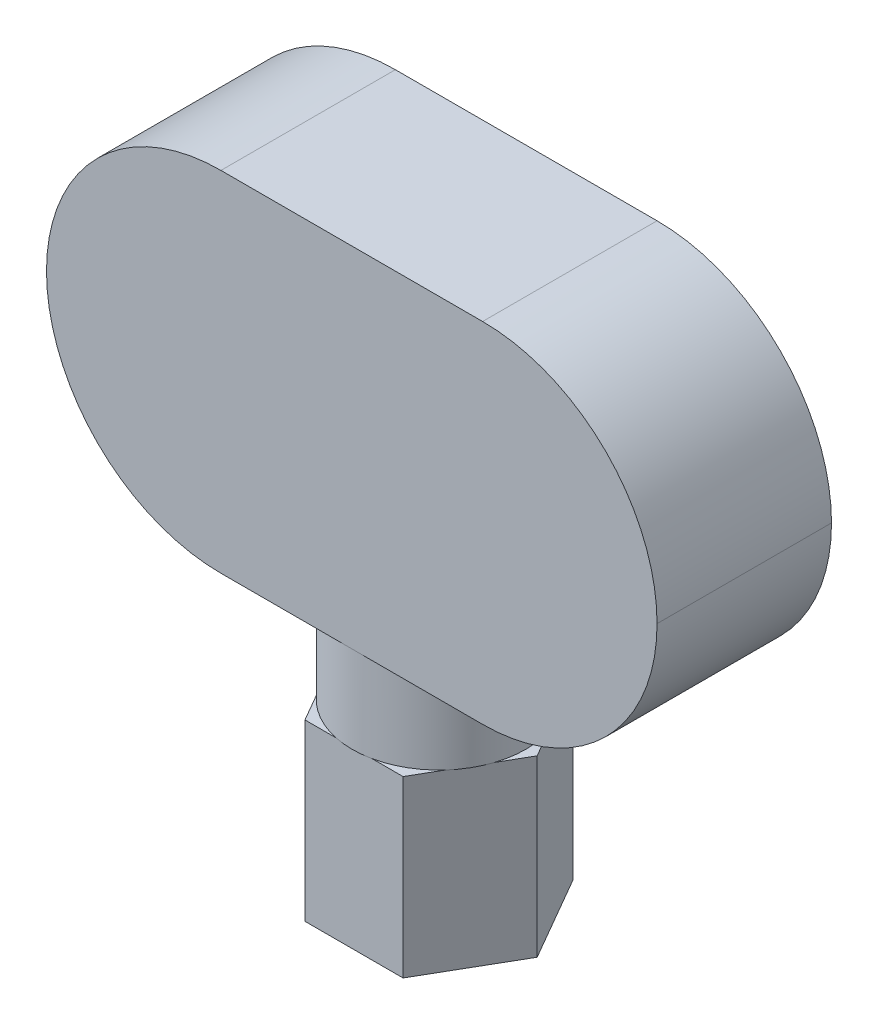
ISO-10303-21;
HEADER;
FILE_DESCRIPTION(('STEP AP214'),'2;1');
FILE_NAME('part.step','',(''),(''),'','','');
FILE_SCHEMA(('AUTOMOTIVE_DESIGN { 1 0 10303 214 1 1 1 1 }'));
ENDSEC;
DATA;
#1=APPLICATION_CONTEXT('core data for automotive mechanical design processes');
#2=APPLICATION_PROTOCOL_DEFINITION('international standard','automotive_design',2000,#1);
#3=PRODUCT_CONTEXT('',#1,'mechanical');
#4=PRODUCT('Part','Part','',(#3));
#5=PRODUCT_RELATED_PRODUCT_CATEGORY('part','',(#4));
#6=PRODUCT_DEFINITION_FORMATION('','',#4);
#7=PRODUCT_DEFINITION_CONTEXT('part definition',#1,'design');
#8=PRODUCT_DEFINITION('design','',#6,#7);
#9=PRODUCT_DEFINITION_SHAPE('','',#8);
#10=(LENGTH_UNIT() NAMED_UNIT(*) SI_UNIT(.MILLI.,.METRE.));
#11=(NAMED_UNIT(*) PLANE_ANGLE_UNIT() SI_UNIT($,.RADIAN.));
#12=(NAMED_UNIT(*) SI_UNIT($,.STERADIAN.) SOLID_ANGLE_UNIT());
#13=UNCERTAINTY_MEASURE_WITH_UNIT(LENGTH_MEASURE(1.E-05),#10,'distance_accuracy_value','');
#14=(GEOMETRIC_REPRESENTATION_CONTEXT(3) GLOBAL_UNCERTAINTY_ASSIGNED_CONTEXT((#13)) GLOBAL_UNIT_ASSIGNED_CONTEXT((#10,
#11,#12)) REPRESENTATION_CONTEXT('',''));
#15=CARTESIAN_POINT('',(0.,0.,0.));
#16=DIRECTION('',(0.,0.,1.));
#17=DIRECTION('',(1.,0.,0.));
#18=AXIS2_PLACEMENT_3D('',#15,#16,#17);
#19=CARTESIAN_POINT('',(0.,4.,0.));
#20=DIRECTION('',(0.,1.,0.));
#21=DIRECTION('',(0.,0.,1.));
#22=AXIS2_PLACEMENT_3D('',#19,#20,#21);
#23=PLANE('',#22);
#24=CARTESIAN_POINT('',(0.,4.,0.));
#25=DIRECTION('',(0.,1.,0.));
#26=DIRECTION('',(0.,0.,1.));
#27=AXIS2_PLACEMENT_3D('',#24,#25,#26);
#28=CIRCLE('',#27,1.99185842870421);
#29=CARTESIAN_POINT('',(0.413067791046463,4.,1.94855715851499));
#30=VERTEX_POINT('',#29);
#31=CARTESIAN_POINT('',(1.48096610447677,4.,1.33200577978885));
#32=VERTEX_POINT('',#31);
#33=EDGE_CURVE('E196',#30,#32,#28,.T.);
#34=ORIENTED_EDGE('',*,*,#33,.F.);
#35=DIRECTION('',(1.,0.,0.));
#36=VECTOR('',#35,1.);
#37=CARTESIAN_POINT('',(-1.125,4.,1.94855715851499));
#38=LINE('',#37,#36);
#39=CARTESIAN_POINT('',(1.125,4.,1.94855715851499));
#40=VERTEX_POINT('',#39);
#41=EDGE_CURVE('E179',#30,#40,#38,.T.);
#42=ORIENTED_EDGE('',*,*,#41,.T.);
#43=DIRECTION('',(0.499999999999999,0.,-0.866025403784439));
#44=VECTOR('',#43,1.);
#45=CARTESIAN_POINT('',(1.125,4.,1.94855715851499));
#46=LINE('',#45,#44);
#47=EDGE_CURVE('E275',#40,#32,#46,.T.);
#48=ORIENTED_EDGE('',*,*,#47,.T.);
#49=EDGE_LOOP('',(#34,#42,#48));
#50=FACE_BOUND('',#49,.T.);
#51=ADVANCED_FACE('F39',(#50),#23,.T.);
#52=CARTESIAN_POINT('',(1.89403389552323,4.,0.61655137872613));
#53=VERTEX_POINT('',#52);
#54=CARTESIAN_POINT('',(1.89403389552323,4.,-0.616551378726134));
#55=VERTEX_POINT('',#54);
#56=EDGE_CURVE('E221',#53,#55,#28,.T.);
#57=ORIENTED_EDGE('',*,*,#56,.F.);
#58=CARTESIAN_POINT('',(2.25,4.,0.));
#59=VERTEX_POINT('',#58);
#60=EDGE_CURVE('E176',#53,#59,#46,.T.);
#61=ORIENTED_EDGE('',*,*,#60,.T.);
#62=DIRECTION('',(-0.5,0.,-0.866025403784439));
#63=VECTOR('',#62,1.);
#64=CARTESIAN_POINT('',(2.25,4.,0.));
#65=LINE('',#64,#63);
#66=EDGE_CURVE('E258',#59,#55,#65,.T.);
#67=ORIENTED_EDGE('',*,*,#66,.T.);
#68=EDGE_LOOP('',(#57,#61,#67));
#69=FACE_BOUND('',#68,.T.);
#70=ADVANCED_FACE('F398',(#69),#23,.T.);
#71=CARTESIAN_POINT('',(1.48096610447677,4.,-1.33200577978885));
#72=VERTEX_POINT('',#71);
#73=CARTESIAN_POINT('',(0.413067791046466,4.,-1.94855715851499));
#74=VERTEX_POINT('',#73);
#75=EDGE_CURVE('E229',#72,#74,#28,.T.);
#76=ORIENTED_EDGE('',*,*,#75,.F.);
#77=CARTESIAN_POINT('',(1.125,4.,-1.94855715851499));
#78=VERTEX_POINT('',#77);
#79=EDGE_CURVE('E299',#72,#78,#65,.T.);
#80=ORIENTED_EDGE('',*,*,#79,.T.);
#81=DIRECTION('',(-1.,0.,0.));
#82=VECTOR('',#81,1.);
#83=CARTESIAN_POINT('',(1.125,4.,-1.94855715851499));
#84=LINE('',#83,#82);
#85=EDGE_CURVE('E260',#78,#74,#84,.T.);
#86=ORIENTED_EDGE('',*,*,#85,.T.);
#87=EDGE_LOOP('',(#76,#80,#86));
#88=FACE_BOUND('',#87,.T.);
#89=ADVANCED_FACE('F404',(#88),#23,.T.);
#90=CARTESIAN_POINT('',(-0.413067791046466,4.,-1.94855715851499));
#91=VERTEX_POINT('',#90);
#92=CARTESIAN_POINT('',(-1.48096610447677,4.,-1.33200577978886));
#93=VERTEX_POINT('',#92);
#94=EDGE_CURVE('E206',#91,#93,#28,.T.);
#95=ORIENTED_EDGE('',*,*,#94,.F.);
#96=CARTESIAN_POINT('',(-1.125,4.,-1.94855715851499));
#97=VERTEX_POINT('',#96);
#98=EDGE_CURVE('E246',#91,#97,#84,.T.);
#99=ORIENTED_EDGE('',*,*,#98,.T.);
#100=DIRECTION('',(-0.5,0.,0.866025403784439));
#101=VECTOR('',#100,1.);
#102=CARTESIAN_POINT('',(-1.125,4.,-1.94855715851499));
#103=LINE('',#102,#101);
#104=EDGE_CURVE('E249',#97,#93,#103,.T.);
#105=ORIENTED_EDGE('',*,*,#104,.T.);
#106=EDGE_LOOP('',(#95,#99,#105));
#107=FACE_BOUND('',#106,.T.);
#108=ADVANCED_FACE('F245',(#107),#23,.T.);
#109=CARTESIAN_POINT('',(-1.89403389552323,4.,-0.616551378726129));
#110=VERTEX_POINT('',#109);
#111=CARTESIAN_POINT('',(-1.89403389552323,4.,0.61655137872613));
#112=VERTEX_POINT('',#111);
#113=EDGE_CURVE('E202',#110,#112,#28,.T.);
#114=ORIENTED_EDGE('',*,*,#113,.F.);
#115=CARTESIAN_POINT('',(-2.25,4.,0.));
#116=VERTEX_POINT('',#115);
#117=EDGE_CURVE('E265',#110,#116,#103,.T.);
#118=ORIENTED_EDGE('',*,*,#117,.T.);
#119=DIRECTION('',(0.5,0.,0.866025403784438));
#120=VECTOR('',#119,1.);
#121=CARTESIAN_POINT('',(-2.25,4.,0.));
#122=LINE('',#121,#120);
#123=EDGE_CURVE('E270',#116,#112,#122,.T.);
#124=ORIENTED_EDGE('',*,*,#123,.T.);
#125=EDGE_LOOP('',(#114,#118,#124));
#126=FACE_BOUND('',#125,.T.);
#127=ADVANCED_FACE('F411',(#126),#23,.T.);
#128=CARTESIAN_POINT('',(2.25,4.,0.));
#129=DIRECTION('',(-0.866025403784439,0.,0.5));
#130=DIRECTION('',(0.5,0.,0.866025403784439));
#131=AXIS2_PLACEMENT_3D('',#128,#129,#130);
#132=PLANE('',#131);
#133=DIRECTION('',(-0.5,0.,-0.866025403784439));
#134=VECTOR('',#133,1.);
#135=CARTESIAN_POINT('',(2.25,0.,0.));
#136=LINE('',#135,#134);
#137=CARTESIAN_POINT('',(2.25,0.,0.));
#138=VERTEX_POINT('',#137);
#139=CARTESIAN_POINT('',(1.125,0.,-1.94855715851499));
#140=VERTEX_POINT('',#139);
#141=EDGE_CURVE('E219',#138,#140,#136,.T.);
#142=ORIENTED_EDGE('',*,*,#141,.T.);
#143=DIRECTION('',(0.,-1.,0.));
#144=VECTOR('',#143,1.);
#145=CARTESIAN_POINT('',(1.125,4.,-1.94855715851499));
#146=LINE('',#145,#144);
#147=EDGE_CURVE('E203',#78,#140,#146,.T.);
#148=ORIENTED_EDGE('',*,*,#147,.F.);
#149=ORIENTED_EDGE('',*,*,#79,.F.);
#150=EDGE_CURVE('E461',#55,#72,#65,.T.);
#151=ORIENTED_EDGE('',*,*,#150,.F.);
#152=ORIENTED_EDGE('',*,*,#66,.F.);
#153=DIRECTION('',(0.,-1.,0.));
#154=VECTOR('',#153,1.);
#155=CARTESIAN_POINT('',(2.25,4.,0.));
#156=LINE('',#155,#154);
#157=EDGE_CURVE('E279',#59,#138,#156,.T.);
#158=ORIENTED_EDGE('',*,*,#157,.T.);
#159=EDGE_LOOP('',(#142,#148,#149,#151,#152,#158));
#160=FACE_BOUND('',#159,.T.);
#161=ADVANCED_FACE('F421',(#160),#132,.F.);
#162=CARTESIAN_POINT('',(1.125,4.,-1.94855715851499));
#163=DIRECTION('',(0.,0.,1.));
#164=DIRECTION('',(1.,0.,0.));
#165=AXIS2_PLACEMENT_3D('',#162,#163,#164);
#166=PLANE('',#165);
#167=DIRECTION('',(-1.,0.,0.));
#168=VECTOR('',#167,1.);
#169=CARTESIAN_POINT('',(1.125,0.,-1.94855715851499));
#170=LINE('',#169,#168);
#171=CARTESIAN_POINT('',(-1.125,0.,-1.94855715851499));
#172=VERTEX_POINT('',#171);
#173=EDGE_CURVE('E284',#140,#172,#170,.T.);
#174=ORIENTED_EDGE('',*,*,#173,.T.);
#175=DIRECTION('',(0.,-1.,0.));
#176=VECTOR('',#175,1.);
#177=CARTESIAN_POINT('',(-1.125,4.,-1.94855715851499));
#178=LINE('',#177,#176);
#179=EDGE_CURVE('E208',#97,#172,#178,.T.);
#180=ORIENTED_EDGE('',*,*,#179,.F.);
#181=ORIENTED_EDGE('',*,*,#98,.F.);
#182=EDGE_CURVE('E254',#74,#91,#84,.T.);
#183=ORIENTED_EDGE('',*,*,#182,.F.);
#184=ORIENTED_EDGE('',*,*,#85,.F.);
#185=ORIENTED_EDGE('',*,*,#147,.T.);
#186=EDGE_LOOP('',(#174,#180,#181,#183,#184,#185));
#187=FACE_BOUND('',#186,.T.);
#188=ADVANCED_FACE('F252',(#187),#166,.F.);
#189=CARTESIAN_POINT('',(-1.125,4.,-1.94855715851499));
#190=DIRECTION('',(0.866025403784439,0.,0.499999999999999));
#191=DIRECTION('',(0.5,0.,-0.866025403784439));
#192=AXIS2_PLACEMENT_3D('',#189,#190,#191);
#193=PLANE('',#192);
#194=DIRECTION('',(-0.5,0.,0.866025403784439));
#195=VECTOR('',#194,1.);
#196=CARTESIAN_POINT('',(-1.125,0.,-1.94855715851499));
#197=LINE('',#196,#195);
#198=CARTESIAN_POINT('',(-2.25,0.,0.));
#199=VERTEX_POINT('',#198);
#200=EDGE_CURVE('E287',#172,#199,#197,.T.);
#201=ORIENTED_EDGE('',*,*,#200,.T.);
#202=DIRECTION('',(0.,-1.,0.));
#203=VECTOR('',#202,1.);
#204=CARTESIAN_POINT('',(-2.25,4.,0.));
#205=LINE('',#204,#203);
#206=EDGE_CURVE('E310',#116,#199,#205,.T.);
#207=ORIENTED_EDGE('',*,*,#206,.F.);
#208=ORIENTED_EDGE('',*,*,#117,.F.);
#209=EDGE_CURVE('E269',#93,#110,#103,.T.);
#210=ORIENTED_EDGE('',*,*,#209,.F.);
#211=ORIENTED_EDGE('',*,*,#104,.F.);
#212=ORIENTED_EDGE('',*,*,#179,.T.);
#213=EDGE_LOOP('',(#201,#207,#208,#210,#211,#212));
#214=FACE_BOUND('',#213,.T.);
#215=ADVANCED_FACE('F434',(#214),#193,.F.);
#216=CARTESIAN_POINT('',(-2.25,4.,0.));
#217=DIRECTION('',(0.866025403784438,0.,-0.5));
#218=DIRECTION('',(-0.5,0.,-0.866025403784438));
#219=AXIS2_PLACEMENT_3D('',#216,#217,#218);
#220=PLANE('',#219);
#221=DIRECTION('',(0.5,0.,0.866025403784438));
#222=VECTOR('',#221,1.);
#223=CARTESIAN_POINT('',(-2.25,0.,0.));
#224=LINE('',#223,#222);
#225=CARTESIAN_POINT('',(-1.125,0.,1.94855715851499));
#226=VERTEX_POINT('',#225);
#227=EDGE_CURVE('E290',#199,#226,#224,.T.);
#228=ORIENTED_EDGE('',*,*,#227,.T.);
#229=DIRECTION('',(0.,-1.,0.));
#230=VECTOR('',#229,1.);
#231=CARTESIAN_POINT('',(-1.125,4.,1.94855715851499));
#232=LINE('',#231,#230);
#233=CARTESIAN_POINT('',(-1.125,4.,1.94855715851499));
#234=VERTEX_POINT('',#233);
#235=EDGE_CURVE('E307',#234,#226,#232,.T.);
#236=ORIENTED_EDGE('',*,*,#235,.F.);
#237=CARTESIAN_POINT('',(-1.48096610447676,4.,1.33200577978886));
#238=VERTEX_POINT('',#237);
#239=EDGE_CURVE('E171',#238,#234,#122,.T.);
#240=ORIENTED_EDGE('',*,*,#239,.F.);
#241=EDGE_CURVE('E273',#112,#238,#122,.T.);
#242=ORIENTED_EDGE('',*,*,#241,.F.);
#243=ORIENTED_EDGE('',*,*,#123,.F.);
#244=ORIENTED_EDGE('',*,*,#206,.T.);
#245=EDGE_LOOP('',(#228,#236,#240,#242,#243,#244));
#246=FACE_BOUND('',#245,.T.);
#247=ADVANCED_FACE('F468',(#246),#220,.F.);
#248=CARTESIAN_POINT('',(-1.125,4.,1.94855715851499));
#249=DIRECTION('',(0.,0.,-1.));
#250=DIRECTION('',(-1.,0.,0.));
#251=AXIS2_PLACEMENT_3D('',#248,#249,#250);
#252=PLANE('',#251);
#253=DIRECTION('',(1.,0.,0.));
#254=VECTOR('',#253,1.);
#255=CARTESIAN_POINT('',(-1.125,0.,1.94855715851499));
#256=LINE('',#255,#254);
#257=CARTESIAN_POINT('',(1.125,0.,1.94855715851499));
#258=VERTEX_POINT('',#257);
#259=EDGE_CURVE('E293',#226,#258,#256,.T.);
#260=ORIENTED_EDGE('',*,*,#259,.T.);
#261=DIRECTION('',(0.,-1.,0.));
#262=VECTOR('',#261,1.);
#263=CARTESIAN_POINT('',(1.125,4.,1.94855715851499));
#264=LINE('',#263,#262);
#265=EDGE_CURVE('E303',#40,#258,#264,.T.);
#266=ORIENTED_EDGE('',*,*,#265,.F.);
#267=ORIENTED_EDGE('',*,*,#41,.F.);
#268=CARTESIAN_POINT('',(-0.413067791046463,4.,1.94855715851499));
#269=VERTEX_POINT('',#268);
#270=EDGE_CURVE('E177',#269,#30,#38,.T.);
#271=ORIENTED_EDGE('',*,*,#270,.F.);
#272=EDGE_CURVE('E165',#234,#269,#38,.T.);
#273=ORIENTED_EDGE('',*,*,#272,.F.);
#274=ORIENTED_EDGE('',*,*,#235,.T.);
#275=EDGE_LOOP('',(#260,#266,#267,#271,#273,#274));
#276=FACE_BOUND('',#275,.T.);
#277=ADVANCED_FACE('F183',(#276),#252,.F.);
#278=CARTESIAN_POINT('',(1.125,4.,1.94855715851499));
#279=DIRECTION('',(-0.866025403784439,0.,-0.5));
#280=DIRECTION('',(-0.5,0.,0.866025403784439));
#281=AXIS2_PLACEMENT_3D('',#278,#279,#280);
#282=PLANE('',#281);
#283=DIRECTION('',(0.499999999999999,0.,-0.866025403784439));
#284=VECTOR('',#283,1.);
#285=CARTESIAN_POINT('',(1.125,0.,1.94855715851499));
#286=LINE('',#285,#284);
#287=EDGE_CURVE('E296',#258,#138,#286,.T.);
#288=ORIENTED_EDGE('',*,*,#287,.T.);
#289=ORIENTED_EDGE('',*,*,#157,.F.);
#290=ORIENTED_EDGE('',*,*,#60,.F.);
#291=EDGE_CURVE('E280',#32,#53,#46,.T.);
#292=ORIENTED_EDGE('',*,*,#291,.F.);
#293=ORIENTED_EDGE('',*,*,#47,.F.);
#294=ORIENTED_EDGE('',*,*,#265,.T.);
#295=EDGE_LOOP('',(#288,#289,#290,#292,#293,#294));
#296=FACE_BOUND('',#295,.T.);
#297=ADVANCED_FACE('F410',(#296),#282,.F.);
#298=EDGE_CURVE('E169',#238,#269,#28,.T.);
#299=ORIENTED_EDGE('',*,*,#298,.F.);
#300=ORIENTED_EDGE('',*,*,#239,.T.);
#301=ORIENTED_EDGE('',*,*,#272,.T.);
#302=EDGE_LOOP('',(#299,#300,#301));
#303=FACE_BOUND('',#302,.T.);
#304=ADVANCED_FACE('F167',(#303),#23,.T.);
#305=CARTESIAN_POINT('',(0.,0.,0.));
#306=DIRECTION('',(0.,1.,0.));
#307=DIRECTION('',(0.,0.,1.));
#308=AXIS2_PLACEMENT_3D('',#305,#306,#307);
#309=PLANE('',#308);
#310=ORIENTED_EDGE('',*,*,#141,.F.);
#311=ORIENTED_EDGE('',*,*,#287,.F.);
#312=ORIENTED_EDGE('',*,*,#259,.F.);
#313=ORIENTED_EDGE('',*,*,#227,.F.);
#314=ORIENTED_EDGE('',*,*,#200,.F.);
#315=ORIENTED_EDGE('',*,*,#173,.F.);
#316=EDGE_LOOP('',(#310,#311,#312,#313,#314,#315));
#317=FACE_BOUND('',#316,.T.);
#318=ADVANCED_FACE('F409',(#317),#309,.F.);
#319=CARTESIAN_POINT('',(0.,4.,0.));
#320=DIRECTION('',(0.,1.,0.));
#321=DIRECTION('',(0.,0.,1.));
#322=AXIS2_PLACEMENT_3D('',#319,#320,#321);
#323=PLANE('',#322);
#324=EDGE_CURVE('E220',#55,#72,#28,.T.);
#325=ORIENTED_EDGE('',*,*,#324,.F.);
#326=ORIENTED_EDGE('',*,*,#150,.T.);
#327=EDGE_LOOP('',(#325,#326));
#328=FACE_BOUND('',#327,.T.);
#329=ADVANCED_FACE('F416',(#328),#323,.F.);
#330=EDGE_CURVE('E226',#74,#91,#28,.T.);
#331=ORIENTED_EDGE('',*,*,#330,.F.);
#332=ORIENTED_EDGE('',*,*,#182,.T.);
#333=EDGE_LOOP('',(#331,#332));
#334=FACE_BOUND('',#333,.T.);
#335=ADVANCED_FACE('F262',(#334),#323,.F.);
#336=EDGE_CURVE('E240',#93,#110,#28,.T.);
#337=ORIENTED_EDGE('',*,*,#336,.F.);
#338=ORIENTED_EDGE('',*,*,#209,.T.);
#339=EDGE_LOOP('',(#337,#338));
#340=FACE_BOUND('',#339,.T.);
#341=ADVANCED_FACE('F437',(#340),#323,.F.);
#342=EDGE_CURVE('E193',#112,#238,#28,.T.);
#343=ORIENTED_EDGE('',*,*,#342,.F.);
#344=ORIENTED_EDGE('',*,*,#241,.T.);
#345=EDGE_LOOP('',(#343,#344));
#346=FACE_BOUND('',#345,.T.);
#347=ADVANCED_FACE('F470',(#346),#323,.F.);
#348=EDGE_CURVE('E188',#269,#30,#28,.T.);
#349=ORIENTED_EDGE('',*,*,#348,.F.);
#350=ORIENTED_EDGE('',*,*,#270,.T.);
#351=EDGE_LOOP('',(#349,#350));
#352=FACE_BOUND('',#351,.T.);
#353=ADVANCED_FACE('F189',(#352),#323,.F.);
#354=EDGE_CURVE('E214',#32,#53,#28,.T.);
#355=ORIENTED_EDGE('',*,*,#354,.F.);
#356=ORIENTED_EDGE('',*,*,#291,.T.);
#357=EDGE_LOOP('',(#355,#356));
#358=FACE_BOUND('',#357,.T.);
#359=ADVANCED_FACE('F447',(#358),#323,.F.);
#360=CARTESIAN_POINT('',(0.,6.,0.));
#361=DIRECTION('',(0.,-1.,0.));
#362=DIRECTION('',(0.,0.,-1.));
#363=AXIS2_PLACEMENT_3D('',#360,#361,#362);
#364=CYLINDRICAL_SURFACE('',#363,1.99185842870421);
#365=CARTESIAN_POINT('',(0.,6.,0.));
#366=DIRECTION('',(0.,1.,0.));
#367=DIRECTION('',(0.,0.,1.));
#368=AXIS2_PLACEMENT_3D('',#365,#366,#367);
#369=CIRCLE('',#368,1.99185842870421);
#370=CARTESIAN_POINT('',(0.,6.,1.99185842870421));
#371=VERTEX_POINT('',#370);
#372=EDGE_CURVE('E213',#371,#371,#369,.T.);
#373=ORIENTED_EDGE('',*,*,#372,.F.);
#374=EDGE_LOOP('',(#373));
#375=FACE_BOUND('',#374,.T.);
#376=ORIENTED_EDGE('',*,*,#33,.T.);
#377=ORIENTED_EDGE('',*,*,#354,.T.);
#378=ORIENTED_EDGE('',*,*,#56,.T.);
#379=ORIENTED_EDGE('',*,*,#324,.T.);
#380=ORIENTED_EDGE('',*,*,#75,.T.);
#381=ORIENTED_EDGE('',*,*,#330,.T.);
#382=ORIENTED_EDGE('',*,*,#94,.T.);
#383=ORIENTED_EDGE('',*,*,#336,.T.);
#384=ORIENTED_EDGE('',*,*,#113,.T.);
#385=ORIENTED_EDGE('',*,*,#342,.T.);
#386=ORIENTED_EDGE('',*,*,#298,.T.);
#387=ORIENTED_EDGE('',*,*,#348,.T.);
#388=EDGE_LOOP('',(#376,#377,#378,#379,#380,#381,#382,#383,#384,#385,#386,#387));
#389=FACE_BOUND('',#388,.T.);
#390=ADVANCED_FACE('F198',(#375,#389),#364,.T.);
#391=CARTESIAN_POINT('',(-7.,14.,-2.));
#392=DIRECTION('',(0.,0.,1.));
#393=DIRECTION('',(1.,0.,0.));
#394=AXIS2_PLACEMENT_3D('',#391,#392,#393);
#395=PLANE('',#394);
#396=CARTESIAN_POINT('',(3.,10.,-2.));
#397=DIRECTION('',(0.,0.,1.));
#398=DIRECTION('',(1.,0.,0.));
#399=AXIS2_PLACEMENT_3D('',#396,#397,#398);
#400=CIRCLE('',#399,4.);
#401=CARTESIAN_POINT('',(3.,14.,-2.));
#402=VERTEX_POINT('',#401);
#403=CARTESIAN_POINT('',(7.,10.,-2.));
#404=VERTEX_POINT('',#403);
#405=EDGE_CURVE('E318',#402,#404,#400,.F.);
#406=ORIENTED_EDGE('',*,*,#405,.T.);
#407=CARTESIAN_POINT('',(3.,10.,-2.));
#408=DIRECTION('',(0.,0.,1.));
#409=DIRECTION('',(1.,0.,0.));
#410=AXIS2_PLACEMENT_3D('',#407,#408,#409);
#411=CIRCLE('',#410,4.);
#412=CARTESIAN_POINT('',(3.,6.,-2.));
#413=VERTEX_POINT('',#412);
#414=EDGE_CURVE('E321',#404,#413,#411,.F.);
#415=ORIENTED_EDGE('',*,*,#414,.T.);
#416=DIRECTION('',(-1.,0.,0.));
#417=VECTOR('',#416,1.);
#418=CARTESIAN_POINT('',(-7.,6.,-2.));
#419=LINE('',#418,#417);
#420=CARTESIAN_POINT('',(-3.,6.,-2.));
#421=VERTEX_POINT('',#420);
#422=EDGE_CURVE('E346',#413,#421,#419,.T.);
#423=ORIENTED_EDGE('',*,*,#422,.T.);
#424=CARTESIAN_POINT('',(-3.,10.,-2.));
#425=DIRECTION('',(0.,0.,1.));
#426=DIRECTION('',(1.,0.,0.));
#427=AXIS2_PLACEMENT_3D('',#424,#425,#426);
#428=CIRCLE('',#427,4.);
#429=CARTESIAN_POINT('',(-7.,10.,-2.));
#430=VERTEX_POINT('',#429);
#431=EDGE_CURVE('E232',#421,#430,#428,.F.);
#432=ORIENTED_EDGE('',*,*,#431,.T.);
#433=CARTESIAN_POINT('',(-3.,10.,-2.));
#434=DIRECTION('',(0.,0.,1.));
#435=DIRECTION('',(1.,0.,0.));
#436=AXIS2_PLACEMENT_3D('',#433,#434,#435);
#437=CIRCLE('',#436,4.);
#438=CARTESIAN_POINT('',(-3.,14.,-2.));
#439=VERTEX_POINT('',#438);
#440=EDGE_CURVE('E228',#430,#439,#437,.F.);
#441=ORIENTED_EDGE('',*,*,#440,.T.);
#442=DIRECTION('',(-1.,0.,0.));
#443=VECTOR('',#442,1.);
#444=CARTESIAN_POINT('',(-7.,14.,-2.));
#445=LINE('',#444,#443);
#446=EDGE_CURVE('E367',#402,#439,#445,.T.);
#447=ORIENTED_EDGE('',*,*,#446,.F.);
#448=EDGE_LOOP('',(#406,#415,#423,#432,#441,#447));
#449=FACE_BOUND('',#448,.T.);
#450=ADVANCED_FACE('F366',(#449),#395,.F.);
#451=CARTESIAN_POINT('',(-7.,14.,2.));
#452=DIRECTION('',(0.,0.,-1.));
#453=DIRECTION('',(-1.,0.,0.));
#454=AXIS2_PLACEMENT_3D('',#451,#452,#453);
#455=PLANE('',#454);
#456=DIRECTION('',(1.,0.,0.));
#457=VECTOR('',#456,1.);
#458=CARTESIAN_POINT('',(-7.,6.,2.));
#459=LINE('',#458,#457);
#460=CARTESIAN_POINT('',(-3.,6.,2.));
#461=VERTEX_POINT('',#460);
#462=CARTESIAN_POINT('',(2.99999999999999,6.,2.));
#463=VERTEX_POINT('',#462);
#464=EDGE_CURVE('E353',#461,#463,#459,.T.);
#465=ORIENTED_EDGE('',*,*,#464,.T.);
#466=CARTESIAN_POINT('',(3.,10.,2.));
#467=DIRECTION('',(0.,0.,-1.));
#468=DIRECTION('',(-1.,0.,0.));
#469=AXIS2_PLACEMENT_3D('',#466,#467,#468);
#470=CIRCLE('',#469,4.);
#471=CARTESIAN_POINT('',(7.,10.,2.));
#472=VERTEX_POINT('',#471);
#473=EDGE_CURVE('E339',#463,#472,#470,.F.);
#474=ORIENTED_EDGE('',*,*,#473,.T.);
#475=CARTESIAN_POINT('',(3.,10.,2.));
#476=DIRECTION('',(0.,0.,-1.));
#477=DIRECTION('',(-1.,0.,0.));
#478=AXIS2_PLACEMENT_3D('',#475,#476,#477);
#479=CIRCLE('',#478,4.);
#480=CARTESIAN_POINT('',(2.99999999999999,14.,2.));
#481=VERTEX_POINT('',#480);
#482=EDGE_CURVE('E63',#472,#481,#479,.F.);
#483=ORIENTED_EDGE('',*,*,#482,.T.);
#484=DIRECTION('',(1.,0.,0.));
#485=VECTOR('',#484,1.);
#486=CARTESIAN_POINT('',(-7.,14.,2.));
#487=LINE('',#486,#485);
#488=CARTESIAN_POINT('',(-3.,14.,2.));
#489=VERTEX_POINT('',#488);
#490=EDGE_CURVE('E194',#489,#481,#487,.T.);
#491=ORIENTED_EDGE('',*,*,#490,.F.);
#492=CARTESIAN_POINT('',(-3.,10.,2.));
#493=DIRECTION('',(0.,0.,-1.));
#494=DIRECTION('',(-1.,0.,0.));
#495=AXIS2_PLACEMENT_3D('',#492,#493,#494);
#496=CIRCLE('',#495,4.);
#497=CARTESIAN_POINT('',(-7.,10.,2.));
#498=VERTEX_POINT('',#497);
#499=EDGE_CURVE('E57',#489,#498,#496,.F.);
#500=ORIENTED_EDGE('',*,*,#499,.T.);
#501=CARTESIAN_POINT('',(-3.,10.,2.));
#502=DIRECTION('',(0.,0.,-1.));
#503=DIRECTION('',(-1.,0.,0.));
#504=AXIS2_PLACEMENT_3D('',#501,#502,#503);
#505=CIRCLE('',#504,4.);
#506=EDGE_CURVE('E334',#498,#461,#505,.F.);
#507=ORIENTED_EDGE('',*,*,#506,.T.);
#508=EDGE_LOOP('',(#465,#474,#483,#491,#500,#507));
#509=FACE_BOUND('',#508,.T.);
#510=ADVANCED_FACE('F380',(#509),#455,.F.);
#511=CARTESIAN_POINT('',(0.,14.,0.));
#512=DIRECTION('',(0.,1.,0.));
#513=DIRECTION('',(0.,0.,1.));
#514=AXIS2_PLACEMENT_3D('',#511,#512,#513);
#515=PLANE('',#514);
#516=ORIENTED_EDGE('',*,*,#490,.T.);
#517=DIRECTION('',(0.,0.,-1.));
#518=VECTOR('',#517,1.);
#519=CARTESIAN_POINT('',(3.,14.,-2.));
#520=LINE('',#519,#518);
#521=EDGE_CURVE('E11',#481,#402,#520,.T.);
#522=ORIENTED_EDGE('',*,*,#521,.T.);
#523=ORIENTED_EDGE('',*,*,#446,.T.);
#524=DIRECTION('',(0.,0.,1.));
#525=VECTOR('',#524,1.);
#526=CARTESIAN_POINT('',(-3.,14.,2.));
#527=LINE('',#526,#525);
#528=EDGE_CURVE('E49',#439,#489,#527,.T.);
#529=ORIENTED_EDGE('',*,*,#528,.T.);
#530=EDGE_LOOP('',(#516,#522,#523,#529));
#531=FACE_BOUND('',#530,.T.);
#532=ADVANCED_FACE('F370',(#531),#515,.T.);
#533=CARTESIAN_POINT('',(0.,6.,0.));
#534=DIRECTION('',(0.,1.,0.));
#535=DIRECTION('',(0.,0.,1.));
#536=AXIS2_PLACEMENT_3D('',#533,#534,#535);
#537=PLANE('',#536);
#538=ORIENTED_EDGE('',*,*,#372,.T.);
#539=EDGE_LOOP('',(#538));
#540=FACE_BOUND('',#539,.T.);
#541=ORIENTED_EDGE('',*,*,#422,.F.);
#542=DIRECTION('',(0.,0.,-1.));
#543=VECTOR('',#542,1.);
#544=CARTESIAN_POINT('',(3.,6.,0.));
#545=LINE('',#544,#543);
#546=EDGE_CURVE('E328',#413,#463,#545,.F.);
#547=ORIENTED_EDGE('',*,*,#546,.T.);
#548=ORIENTED_EDGE('',*,*,#464,.F.);
#549=DIRECTION('',(0.,0.,1.));
#550=VECTOR('',#549,1.);
#551=CARTESIAN_POINT('',(-3.,6.,0.));
#552=LINE('',#551,#550);
#553=EDGE_CURVE('E324',#461,#421,#552,.F.);
#554=ORIENTED_EDGE('',*,*,#553,.T.);
#555=EDGE_LOOP('',(#541,#547,#548,#554));
#556=FACE_BOUND('',#555,.T.);
#557=ADVANCED_FACE('F383',(#540,#556),#537,.F.);
#558=CARTESIAN_POINT('',(3.,10.,0.));
#559=DIRECTION('',(0.,0.,1.));
#560=DIRECTION('',(1.,0.,0.));
#561=AXIS2_PLACEMENT_3D('',#558,#559,#560);
#562=CYLINDRICAL_SURFACE('',#561,4.);
#563=ORIENTED_EDGE('',*,*,#521,.F.);
#564=ORIENTED_EDGE('',*,*,#482,.F.);
#565=DIRECTION('',(0.,0.,-1.));
#566=VECTOR('',#565,1.);
#567=CARTESIAN_POINT('',(7.,10.,2.));
#568=LINE('',#567,#566);
#569=EDGE_CURVE('E343',#404,#472,#568,.F.);
#570=ORIENTED_EDGE('',*,*,#569,.F.);
#571=ORIENTED_EDGE('',*,*,#405,.F.);
#572=EDGE_LOOP('',(#563,#564,#570,#571));
#573=FACE_BOUND('',#572,.T.);
#574=ADVANCED_FACE('F387',(#573),#562,.T.);
#575=CARTESIAN_POINT('',(3.,10.,-2.));
#576=DIRECTION('',(0.,0.,-1.));
#577=DIRECTION('',(-1.,0.,0.));
#578=AXIS2_PLACEMENT_3D('',#575,#576,#577);
#579=CYLINDRICAL_SURFACE('',#578,4.);
#580=ORIENTED_EDGE('',*,*,#473,.F.);
#581=ORIENTED_EDGE('',*,*,#546,.F.);
#582=ORIENTED_EDGE('',*,*,#414,.F.);
#583=ORIENTED_EDGE('',*,*,#569,.T.);
#584=EDGE_LOOP('',(#580,#581,#582,#583));
#585=FACE_BOUND('',#584,.T.);
#586=ADVANCED_FACE('F385',(#585),#579,.T.);
#587=CARTESIAN_POINT('',(-3.,10.,0.));
#588=DIRECTION('',(0.,0.,-1.));
#589=DIRECTION('',(-1.,0.,0.));
#590=AXIS2_PLACEMENT_3D('',#587,#588,#589);
#591=CYLINDRICAL_SURFACE('',#590,4.);
#592=ORIENTED_EDGE('',*,*,#528,.F.);
#593=ORIENTED_EDGE('',*,*,#440,.F.);
#594=DIRECTION('',(0.,0.,1.));
#595=VECTOR('',#594,1.);
#596=CARTESIAN_POINT('',(-7.,10.,-2.));
#597=LINE('',#596,#595);
#598=EDGE_CURVE('E43',#498,#430,#597,.F.);
#599=ORIENTED_EDGE('',*,*,#598,.F.);
#600=ORIENTED_EDGE('',*,*,#499,.F.);
#601=EDGE_LOOP('',(#592,#593,#599,#600));
#602=FACE_BOUND('',#601,.T.);
#603=ADVANCED_FACE('F41',(#602),#591,.T.);
#604=CARTESIAN_POINT('',(-3.,10.,-2.));
#605=DIRECTION('',(0.,0.,1.));
#606=DIRECTION('',(1.,0.,0.));
#607=AXIS2_PLACEMENT_3D('',#604,#605,#606);
#608=CYLINDRICAL_SURFACE('',#607,4.);
#609=ORIENTED_EDGE('',*,*,#431,.F.);
#610=ORIENTED_EDGE('',*,*,#553,.F.);
#611=ORIENTED_EDGE('',*,*,#506,.F.);
#612=ORIENTED_EDGE('',*,*,#598,.T.);
#613=EDGE_LOOP('',(#609,#610,#611,#612));
#614=FACE_BOUND('',#613,.T.);
#615=ADVANCED_FACE('F358',(#614),#608,.T.);
#616=CLOSED_SHELL('',(#51,#70,#89,#108,#127,#161,#188,#215,#247,#277,#297,#304,#318,#329,#335,
#341,#347,#353,#359,#390,#450,#510,#532,#557,#574,#586,#603,#615));
#617=MANIFOLD_SOLID_BREP('B2',#616);
#618=ADVANCED_BREP_SHAPE_REPRESENTATION('',(#18,#617),#14);
#619=SHAPE_DEFINITION_REPRESENTATION(#9,#618);
ENDSEC;
END-ISO-10303-21;
